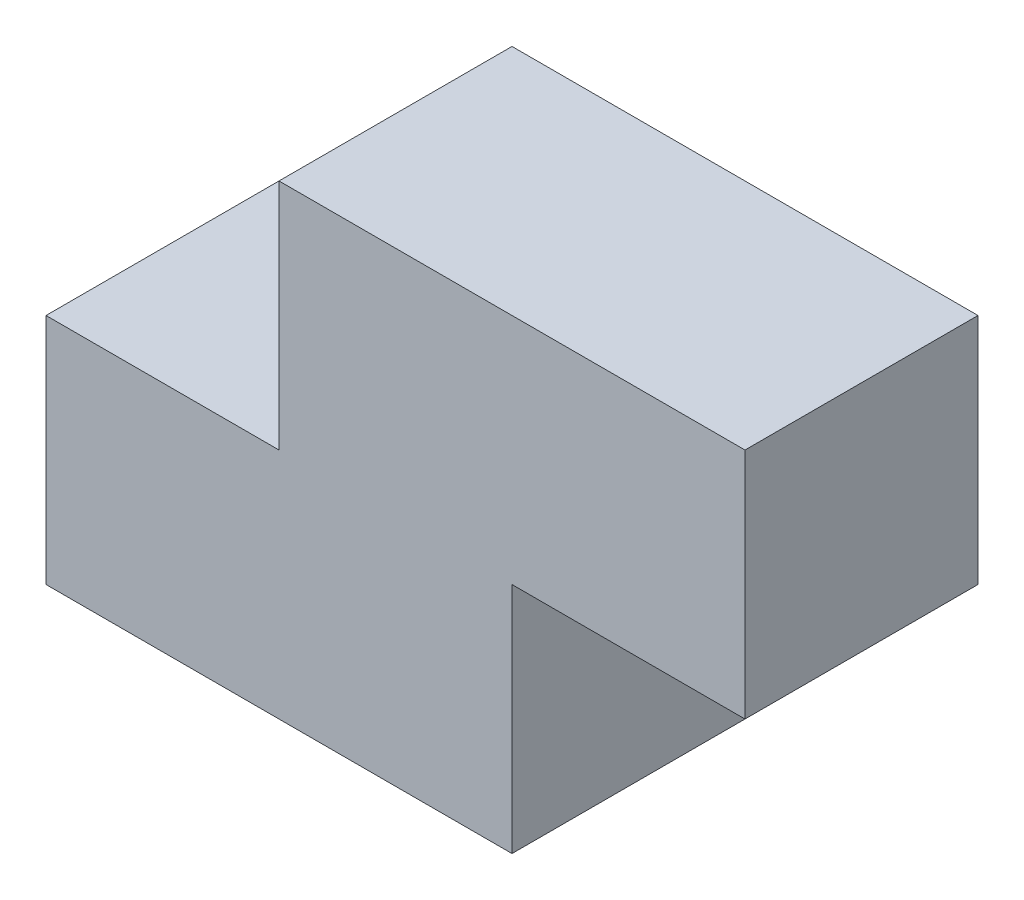
ISO-10303-21;
HEADER;
FILE_DESCRIPTION(('STEP AP214'),'2;1');
FILE_NAME('part.step','',(''),(''),'','','');
FILE_SCHEMA(('AUTOMOTIVE_DESIGN { 1 0 10303 214 1 1 1 1 }'));
ENDSEC;
DATA;
#1=APPLICATION_CONTEXT('core data for automotive mechanical design processes');
#2=APPLICATION_PROTOCOL_DEFINITION('international standard','automotive_design',2000,#1);
#3=PRODUCT_CONTEXT('',#1,'mechanical');
#4=PRODUCT('Part','Part','',(#3));
#5=PRODUCT_RELATED_PRODUCT_CATEGORY('part','',(#4));
#6=PRODUCT_DEFINITION_FORMATION('','',#4);
#7=PRODUCT_DEFINITION_CONTEXT('part definition',#1,'design');
#8=PRODUCT_DEFINITION('design','',#6,#7);
#9=PRODUCT_DEFINITION_SHAPE('','',#8);
#10=(LENGTH_UNIT() NAMED_UNIT(*) SI_UNIT(.MILLI.,.METRE.));
#11=(NAMED_UNIT(*) PLANE_ANGLE_UNIT() SI_UNIT($,.RADIAN.));
#12=(NAMED_UNIT(*) SI_UNIT($,.STERADIAN.) SOLID_ANGLE_UNIT());
#13=UNCERTAINTY_MEASURE_WITH_UNIT(LENGTH_MEASURE(1.E-05),#10,'distance_accuracy_value','');
#14=(GEOMETRIC_REPRESENTATION_CONTEXT(3) GLOBAL_UNCERTAINTY_ASSIGNED_CONTEXT((#13)) GLOBAL_UNIT_ASSIGNED_CONTEXT((#10,
#11,#12)) REPRESENTATION_CONTEXT('',''));
#15=CARTESIAN_POINT('',(0.,0.,0.));
#16=DIRECTION('',(0.,0.,1.));
#17=DIRECTION('',(1.,0.,0.));
#18=AXIS2_PLACEMENT_3D('',#15,#16,#17);
#19=CARTESIAN_POINT('',(0.,30.,30.));
#20=DIRECTION('',(1.,0.,0.));
#21=DIRECTION('',(0.,1.,0.));
#22=AXIS2_PLACEMENT_3D('',#19,#20,#21);
#23=PLANE('',#22);
#24=DIRECTION('',(0.,-1.,0.));
#25=VECTOR('',#24,1.);
#26=CARTESIAN_POINT('',(0.,30.,0.));
#27=LINE('',#26,#25);
#28=CARTESIAN_POINT('',(0.,30.,0.));
#29=VERTEX_POINT('',#28);
#30=CARTESIAN_POINT('',(0.,0.,0.));
#31=VERTEX_POINT('',#30);
#32=EDGE_CURVE('E143',#29,#31,#27,.T.);
#33=ORIENTED_EDGE('',*,*,#32,.T.);
#34=DIRECTION('',(0.,0.,-1.));
#35=VECTOR('',#34,1.);
#36=CARTESIAN_POINT('',(0.,0.,30.));
#37=LINE('',#36,#35);
#38=CARTESIAN_POINT('',(0.,0.,30.));
#39=VERTEX_POINT('',#38);
#40=EDGE_CURVE('E11',#39,#31,#37,.T.);
#41=ORIENTED_EDGE('',*,*,#40,.F.);
#42=DIRECTION('',(0.,-1.,0.));
#43=VECTOR('',#42,1.);
#44=CARTESIAN_POINT('',(0.,30.,30.));
#45=LINE('',#44,#43);
#46=CARTESIAN_POINT('',(0.,30.,30.));
#47=VERTEX_POINT('',#46);
#48=EDGE_CURVE('E165',#47,#39,#45,.T.);
#49=ORIENTED_EDGE('',*,*,#48,.F.);
#50=DIRECTION('',(0.,0.,-1.));
#51=VECTOR('',#50,1.);
#52=CARTESIAN_POINT('',(0.,30.,30.));
#53=LINE('',#52,#51);
#54=EDGE_CURVE('E139',#47,#29,#53,.T.);
#55=ORIENTED_EDGE('',*,*,#54,.T.);
#56=EDGE_LOOP('',(#33,#41,#49,#55));
#57=FACE_BOUND('',#56,.T.);
#58=ADVANCED_FACE('F42',(#57),#23,.F.);
#59=CARTESIAN_POINT('',(0.,0.,30.));
#60=DIRECTION('',(0.,1.,0.));
#61=DIRECTION('',(0.,0.,1.));
#62=AXIS2_PLACEMENT_3D('',#59,#60,#61);
#63=PLANE('',#62);
#64=DIRECTION('',(1.,0.,0.));
#65=VECTOR('',#64,1.);
#66=CARTESIAN_POINT('',(0.,0.,0.));
#67=LINE('',#66,#65);
#68=CARTESIAN_POINT('',(60.,0.,0.));
#69=VERTEX_POINT('',#68);
#70=EDGE_CURVE('E147',#31,#69,#67,.T.);
#71=ORIENTED_EDGE('',*,*,#70,.T.);
#72=DIRECTION('',(0.,0.,-1.));
#73=VECTOR('',#72,1.);
#74=CARTESIAN_POINT('',(60.,0.,30.));
#75=LINE('',#74,#73);
#76=CARTESIAN_POINT('',(60.,0.,30.));
#77=VERTEX_POINT('',#76);
#78=EDGE_CURVE('E51',#77,#69,#75,.T.);
#79=ORIENTED_EDGE('',*,*,#78,.F.);
#80=DIRECTION('',(1.,0.,0.));
#81=VECTOR('',#80,1.);
#82=CARTESIAN_POINT('',(0.,0.,30.));
#83=LINE('',#82,#81);
#84=EDGE_CURVE('E102',#39,#77,#83,.T.);
#85=ORIENTED_EDGE('',*,*,#84,.F.);
#86=ORIENTED_EDGE('',*,*,#40,.T.);
#87=EDGE_LOOP('',(#71,#79,#85,#86));
#88=FACE_BOUND('',#87,.T.);
#89=ADVANCED_FACE('F211',(#88),#63,.F.);
#90=CARTESIAN_POINT('',(60.,0.,30.));
#91=DIRECTION('',(-1.,0.,0.));
#92=DIRECTION('',(0.,0.,1.));
#93=AXIS2_PLACEMENT_3D('',#90,#91,#92);
#94=PLANE('',#93);
#95=DIRECTION('',(0.,1.,0.));
#96=VECTOR('',#95,1.);
#97=CARTESIAN_POINT('',(60.,0.,0.));
#98=LINE('',#97,#96);
#99=CARTESIAN_POINT('',(60.,30.,0.));
#100=VERTEX_POINT('',#99);
#101=EDGE_CURVE('E150',#69,#100,#98,.T.);
#102=ORIENTED_EDGE('',*,*,#101,.T.);
#103=DIRECTION('',(0.,0.,-1.));
#104=VECTOR('',#103,1.);
#105=CARTESIAN_POINT('',(60.,30.,30.));
#106=LINE('',#105,#104);
#107=CARTESIAN_POINT('',(60.,30.,30.));
#108=VERTEX_POINT('',#107);
#109=EDGE_CURVE('E176',#108,#100,#106,.T.);
#110=ORIENTED_EDGE('',*,*,#109,.F.);
#111=DIRECTION('',(0.,1.,0.));
#112=VECTOR('',#111,1.);
#113=CARTESIAN_POINT('',(60.,0.,30.));
#114=LINE('',#113,#112);
#115=EDGE_CURVE('E186',#77,#108,#114,.T.);
#116=ORIENTED_EDGE('',*,*,#115,.F.);
#117=ORIENTED_EDGE('',*,*,#78,.T.);
#118=EDGE_LOOP('',(#102,#110,#116,#117));
#119=FACE_BOUND('',#118,.T.);
#120=ADVANCED_FACE('F184',(#119),#94,.F.);
#121=CARTESIAN_POINT('',(60.,30.,30.));
#122=DIRECTION('',(0.,1.,0.));
#123=DIRECTION('',(0.,0.,1.));
#124=AXIS2_PLACEMENT_3D('',#121,#122,#123);
#125=PLANE('',#124);
#126=DIRECTION('',(1.,0.,0.));
#127=VECTOR('',#126,1.);
#128=CARTESIAN_POINT('',(60.,30.,0.));
#129=LINE('',#128,#127);
#130=CARTESIAN_POINT('',(90.,30.,0.));
#131=VERTEX_POINT('',#130);
#132=EDGE_CURVE('E153',#100,#131,#129,.T.);
#133=ORIENTED_EDGE('',*,*,#132,.T.);
#134=DIRECTION('',(0.,0.,-1.));
#135=VECTOR('',#134,1.);
#136=CARTESIAN_POINT('',(90.,30.,30.));
#137=LINE('',#136,#135);
#138=CARTESIAN_POINT('',(90.,30.,30.));
#139=VERTEX_POINT('',#138);
#140=EDGE_CURVE('E172',#139,#131,#137,.T.);
#141=ORIENTED_EDGE('',*,*,#140,.F.);
#142=DIRECTION('',(1.,0.,0.));
#143=VECTOR('',#142,1.);
#144=CARTESIAN_POINT('',(60.,30.,30.));
#145=LINE('',#144,#143);
#146=EDGE_CURVE('E199',#108,#139,#145,.T.);
#147=ORIENTED_EDGE('',*,*,#146,.F.);
#148=ORIENTED_EDGE('',*,*,#109,.T.);
#149=EDGE_LOOP('',(#133,#141,#147,#148));
#150=FACE_BOUND('',#149,.T.);
#151=ADVANCED_FACE('F194',(#150),#125,.F.);
#152=CARTESIAN_POINT('',(90.,30.,30.));
#153=DIRECTION('',(-1.,0.,0.));
#154=DIRECTION('',(0.,0.,1.));
#155=AXIS2_PLACEMENT_3D('',#152,#153,#154);
#156=PLANE('',#155);
#157=DIRECTION('',(0.,1.,0.));
#158=VECTOR('',#157,1.);
#159=CARTESIAN_POINT('',(90.,30.,0.));
#160=LINE('',#159,#158);
#161=CARTESIAN_POINT('',(90.,60.,0.));
#162=VERTEX_POINT('',#161);
#163=EDGE_CURVE('E156',#131,#162,#160,.T.);
#164=ORIENTED_EDGE('',*,*,#163,.T.);
#165=DIRECTION('',(0.,0.,-1.));
#166=VECTOR('',#165,1.);
#167=CARTESIAN_POINT('',(90.,60.,30.));
#168=LINE('',#167,#166);
#169=CARTESIAN_POINT('',(90.,60.,30.));
#170=VERTEX_POINT('',#169);
#171=EDGE_CURVE('E132',#170,#162,#168,.T.);
#172=ORIENTED_EDGE('',*,*,#171,.F.);
#173=DIRECTION('',(0.,1.,0.));
#174=VECTOR('',#173,1.);
#175=CARTESIAN_POINT('',(90.,30.,30.));
#176=LINE('',#175,#174);
#177=EDGE_CURVE('E121',#139,#170,#176,.T.);
#178=ORIENTED_EDGE('',*,*,#177,.F.);
#179=ORIENTED_EDGE('',*,*,#140,.T.);
#180=EDGE_LOOP('',(#164,#172,#178,#179));
#181=FACE_BOUND('',#180,.T.);
#182=ADVANCED_FACE('F197',(#181),#156,.F.);
#183=CARTESIAN_POINT('',(90.,60.,30.));
#184=DIRECTION('',(0.,-1.,0.));
#185=DIRECTION('',(1.,0.,0.));
#186=AXIS2_PLACEMENT_3D('',#183,#184,#185);
#187=PLANE('',#186);
#188=DIRECTION('',(-1.,0.,0.));
#189=VECTOR('',#188,1.);
#190=CARTESIAN_POINT('',(90.,60.,0.));
#191=LINE('',#190,#189);
#192=CARTESIAN_POINT('',(30.,60.,0.));
#193=VERTEX_POINT('',#192);
#194=EDGE_CURVE('E130',#162,#193,#191,.T.);
#195=ORIENTED_EDGE('',*,*,#194,.T.);
#196=DIRECTION('',(0.,0.,-1.));
#197=VECTOR('',#196,1.);
#198=CARTESIAN_POINT('',(30.,60.,30.));
#199=LINE('',#198,#197);
#200=CARTESIAN_POINT('',(30.,60.,30.));
#201=VERTEX_POINT('',#200);
#202=EDGE_CURVE('E127',#201,#193,#199,.T.);
#203=ORIENTED_EDGE('',*,*,#202,.F.);
#204=DIRECTION('',(-1.,0.,0.));
#205=VECTOR('',#204,1.);
#206=CARTESIAN_POINT('',(90.,60.,30.));
#207=LINE('',#206,#205);
#208=EDGE_CURVE('E115',#170,#201,#207,.T.);
#209=ORIENTED_EDGE('',*,*,#208,.F.);
#210=ORIENTED_EDGE('',*,*,#171,.T.);
#211=EDGE_LOOP('',(#195,#203,#209,#210));
#212=FACE_BOUND('',#211,.T.);
#213=ADVANCED_FACE('F128',(#212),#187,.F.);
#214=CARTESIAN_POINT('',(30.,60.,30.));
#215=DIRECTION('',(1.,0.,0.));
#216=DIRECTION('',(0.,1.,0.));
#217=AXIS2_PLACEMENT_3D('',#214,#215,#216);
#218=PLANE('',#217);
#219=DIRECTION('',(0.,-1.,0.));
#220=VECTOR('',#219,1.);
#221=CARTESIAN_POINT('',(30.,60.,0.));
#222=LINE('',#221,#220);
#223=CARTESIAN_POINT('',(30.,30.,0.));
#224=VERTEX_POINT('',#223);
#225=EDGE_CURVE('E88',#193,#224,#222,.T.);
#226=ORIENTED_EDGE('',*,*,#225,.T.);
#227=DIRECTION('',(0.,0.,-1.));
#228=VECTOR('',#227,1.);
#229=CARTESIAN_POINT('',(30.,30.,30.));
#230=LINE('',#229,#228);
#231=CARTESIAN_POINT('',(30.,30.,30.));
#232=VERTEX_POINT('',#231);
#233=EDGE_CURVE('E133',#232,#224,#230,.T.);
#234=ORIENTED_EDGE('',*,*,#233,.F.);
#235=DIRECTION('',(0.,-1.,0.));
#236=VECTOR('',#235,1.);
#237=CARTESIAN_POINT('',(30.,60.,30.));
#238=LINE('',#237,#236);
#239=EDGE_CURVE('E119',#201,#232,#238,.T.);
#240=ORIENTED_EDGE('',*,*,#239,.F.);
#241=ORIENTED_EDGE('',*,*,#202,.T.);
#242=EDGE_LOOP('',(#226,#234,#240,#241));
#243=FACE_BOUND('',#242,.T.);
#244=ADVANCED_FACE('F135',(#243),#218,.F.);
#245=CARTESIAN_POINT('',(30.,30.,30.));
#246=DIRECTION('',(0.,-1.,0.));
#247=DIRECTION('',(1.,0.,0.));
#248=AXIS2_PLACEMENT_3D('',#245,#246,#247);
#249=PLANE('',#248);
#250=DIRECTION('',(-1.,0.,0.));
#251=VECTOR('',#250,1.);
#252=CARTESIAN_POINT('',(30.,30.,0.));
#253=LINE('',#252,#251);
#254=EDGE_CURVE('E94',#224,#29,#253,.T.);
#255=ORIENTED_EDGE('',*,*,#254,.T.);
#256=ORIENTED_EDGE('',*,*,#54,.F.);
#257=DIRECTION('',(-1.,0.,0.));
#258=VECTOR('',#257,1.);
#259=CARTESIAN_POINT('',(30.,30.,30.));
#260=LINE('',#259,#258);
#261=EDGE_CURVE('E59',#232,#47,#260,.T.);
#262=ORIENTED_EDGE('',*,*,#261,.F.);
#263=ORIENTED_EDGE('',*,*,#233,.T.);
#264=EDGE_LOOP('',(#255,#256,#262,#263));
#265=FACE_BOUND('',#264,.T.);
#266=ADVANCED_FACE('F227',(#265),#249,.F.);
#267=CARTESIAN_POINT('',(0.,0.,30.));
#268=DIRECTION('',(0.,0.,1.));
#269=DIRECTION('',(1.,0.,0.));
#270=AXIS2_PLACEMENT_3D('',#267,#268,#269);
#271=PLANE('',#270);
#272=ORIENTED_EDGE('',*,*,#48,.T.);
#273=ORIENTED_EDGE('',*,*,#84,.T.);
#274=ORIENTED_EDGE('',*,*,#115,.T.);
#275=ORIENTED_EDGE('',*,*,#146,.T.);
#276=ORIENTED_EDGE('',*,*,#177,.T.);
#277=ORIENTED_EDGE('',*,*,#208,.T.);
#278=ORIENTED_EDGE('',*,*,#239,.T.);
#279=ORIENTED_EDGE('',*,*,#261,.T.);
#280=EDGE_LOOP('',(#272,#273,#274,#275,#276,#277,#278,#279));
#281=FACE_BOUND('',#280,.T.);
#282=ADVANCED_FACE('F117',(#281),#271,.T.);
#283=CARTESIAN_POINT('',(0.,0.,0.));
#284=DIRECTION('',(0.,0.,1.));
#285=DIRECTION('',(1.,0.,0.));
#286=AXIS2_PLACEMENT_3D('',#283,#284,#285);
#287=PLANE('',#286);
#288=ORIENTED_EDGE('',*,*,#32,.F.);
#289=ORIENTED_EDGE('',*,*,#254,.F.);
#290=ORIENTED_EDGE('',*,*,#225,.F.);
#291=ORIENTED_EDGE('',*,*,#194,.F.);
#292=ORIENTED_EDGE('',*,*,#163,.F.);
#293=ORIENTED_EDGE('',*,*,#132,.F.);
#294=ORIENTED_EDGE('',*,*,#101,.F.);
#295=ORIENTED_EDGE('',*,*,#70,.F.);
#296=EDGE_LOOP('',(#288,#289,#290,#291,#292,#293,#294,#295));
#297=FACE_BOUND('',#296,.T.);
#298=ADVANCED_FACE('F190',(#297),#287,.F.);
#299=CLOSED_SHELL('',(#58,#89,#120,#151,#182,#213,#244,#266,#282,#298));
#300=MANIFOLD_SOLID_BREP('B2',#299);
#301=ADVANCED_BREP_SHAPE_REPRESENTATION('',(#18,#300),#14);
#302=SHAPE_DEFINITION_REPRESENTATION(#9,#301);
ENDSEC;
END-ISO-10303-21;
